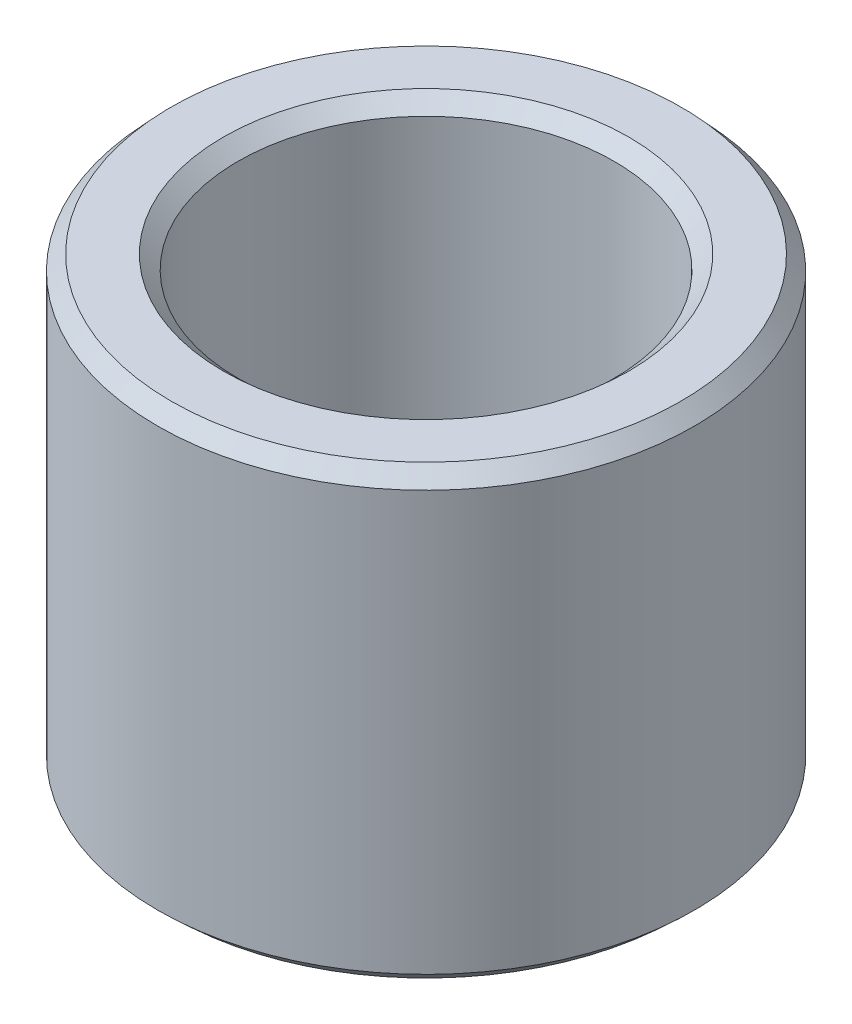
ISO-10303-21;
HEADER;
FILE_DESCRIPTION(('STEP AP214'),'2;1');
FILE_NAME('part.step','',(''),(''),'','','');
FILE_SCHEMA(('AUTOMOTIVE_DESIGN { 1 0 10303 214 1 1 1 1 }'));
ENDSEC;
DATA;
#1=APPLICATION_CONTEXT('core data for automotive mechanical design processes');
#2=APPLICATION_PROTOCOL_DEFINITION('international standard','automotive_design',2000,#1);
#3=PRODUCT_CONTEXT('',#1,'mechanical');
#4=PRODUCT('Part','Part','',(#3));
#5=PRODUCT_RELATED_PRODUCT_CATEGORY('part','',(#4));
#6=PRODUCT_DEFINITION_FORMATION('','',#4);
#7=PRODUCT_DEFINITION_CONTEXT('part definition',#1,'design');
#8=PRODUCT_DEFINITION('design','',#6,#7);
#9=PRODUCT_DEFINITION_SHAPE('','',#8);
#10=(LENGTH_UNIT() NAMED_UNIT(*) SI_UNIT(.MILLI.,.METRE.));
#11=(NAMED_UNIT(*) PLANE_ANGLE_UNIT() SI_UNIT($,.RADIAN.));
#12=(NAMED_UNIT(*) SI_UNIT($,.STERADIAN.) SOLID_ANGLE_UNIT());
#13=UNCERTAINTY_MEASURE_WITH_UNIT(LENGTH_MEASURE(1.E-05),#10,'distance_accuracy_value','');
#14=(GEOMETRIC_REPRESENTATION_CONTEXT(3) GLOBAL_UNCERTAINTY_ASSIGNED_CONTEXT((#13)) GLOBAL_UNIT_ASSIGNED_CONTEXT((#10,
#11,#12)) REPRESENTATION_CONTEXT('',''));
#15=CARTESIAN_POINT('',(0.,0.,0.));
#16=DIRECTION('',(0.,0.,1.));
#17=DIRECTION('',(1.,0.,0.));
#18=AXIS2_PLACEMENT_3D('',#15,#16,#17);
#19=CARTESIAN_POINT('',(0.,100.026628008681,0.));
#20=DIRECTION('',(0.,-1.,0.));
#21=DIRECTION('',(0.,0.,-1.));
#22=AXIS2_PLACEMENT_3D('',#19,#20,#21);
#23=CYLINDRICAL_SURFACE('',#22,60.);
#24=CARTESIAN_POINT('',(0.,3.04005425540567,0.));
#25=DIRECTION('',(0.,1.,0.));
#26=DIRECTION('',(0.,0.,1.));
#27=AXIS2_PLACEMENT_3D('',#24,#25,#26);
#28=CIRCLE('',#27,60.);
#29=CARTESIAN_POINT('',(0.,3.04005425540567,60.));
#30=VERTEX_POINT('',#29);
#31=EDGE_CURVE('E10',#30,#30,#28,.T.);
#32=ORIENTED_EDGE('',*,*,#31,.T.);
#33=EDGE_LOOP('',(#32));
#34=FACE_BOUND('',#33,.T.);
#35=CARTESIAN_POINT('',(0.,96.7378545931816,0.));
#36=DIRECTION('',(0.,1.,0.));
#37=DIRECTION('',(0.,0.,1.));
#38=AXIS2_PLACEMENT_3D('',#35,#36,#37);
#39=CIRCLE('',#38,60.);
#40=CARTESIAN_POINT('',(0.,96.7378545931816,60.));
#41=VERTEX_POINT('',#40);
#42=EDGE_CURVE('E50',#41,#41,#39,.F.);
#43=ORIENTED_EDGE('',*,*,#42,.T.);
#44=EDGE_LOOP('',(#43));
#45=FACE_BOUND('',#44,.T.);
#46=ADVANCED_FACE('F39',(#34,#45),#23,.T.);
#47=CARTESIAN_POINT('',(0.,100.026628008681,0.));
#48=DIRECTION('',(0.,1.,0.));
#49=DIRECTION('',(0.,0.,1.));
#50=AXIS2_PLACEMENT_3D('',#47,#48,#49);
#51=PLANE('',#50);
#52=CARTESIAN_POINT('',(0.,100.026628008681,0.));
#53=DIRECTION('',(0.,1.,0.));
#54=DIRECTION('',(0.,0.,1.));
#55=AXIS2_PLACEMENT_3D('',#52,#53,#54);
#56=CIRCLE('',#55,45.3146546919656);
#57=CARTESIAN_POINT('',(0.,100.026628008681,45.3146546919656));
#58=VERTEX_POINT('',#57);
#59=EDGE_CURVE('E58',#58,#58,#56,.F.);
#60=ORIENTED_EDGE('',*,*,#59,.T.);
#61=EDGE_LOOP('',(#60));
#62=FACE_BOUND('',#61,.T.);
#63=CARTESIAN_POINT('',(0.,100.026628008681,0.));
#64=DIRECTION('',(0.,1.,0.));
#65=DIRECTION('',(0.,0.,1.));
#66=AXIS2_PLACEMENT_3D('',#63,#64,#65);
#67=CIRCLE('',#66,56.9599457445943);
#68=CARTESIAN_POINT('',(0.,100.026628008681,56.9599457445943));
#69=VERTEX_POINT('',#68);
#70=EDGE_CURVE('E61',#69,#69,#67,.T.);
#71=ORIENTED_EDGE('',*,*,#70,.T.);
#72=EDGE_LOOP('',(#71));
#73=FACE_BOUND('',#72,.T.);
#74=ADVANCED_FACE('F88',(#62,#73),#51,.T.);
#75=CARTESIAN_POINT('',(0.,0.,0.));
#76=DIRECTION('',(0.,1.,0.));
#77=DIRECTION('',(0.,0.,1.));
#78=AXIS2_PLACEMENT_3D('',#75,#76,#77);
#79=PLANE('',#78);
#80=CARTESIAN_POINT('',(0.,0.,0.));
#81=DIRECTION('',(0.,1.,0.));
#82=DIRECTION('',(0.,0.,1.));
#83=AXIS2_PLACEMENT_3D('',#80,#81,#82);
#84=CIRCLE('',#83,45.0659355318715);
#85=CARTESIAN_POINT('',(0.,0.,45.0659355318715));
#86=VERTEX_POINT('',#85);
#87=EDGE_CURVE('E51',#86,#86,#84,.T.);
#88=ORIENTED_EDGE('',*,*,#87,.T.);
#89=EDGE_LOOP('',(#88));
#90=FACE_BOUND('',#89,.T.);
#91=CARTESIAN_POINT('',(0.,0.,0.));
#92=DIRECTION('',(0.,1.,0.));
#93=DIRECTION('',(0.,0.,1.));
#94=AXIS2_PLACEMENT_3D('',#91,#92,#93);
#95=CIRCLE('',#94,56.7112265845003);
#96=CARTESIAN_POINT('',(0.,0.,56.7112265845003));
#97=VERTEX_POINT('',#96);
#98=EDGE_CURVE('E54',#97,#97,#95,.F.);
#99=ORIENTED_EDGE('',*,*,#98,.T.);
#100=EDGE_LOOP('',(#99));
#101=FACE_BOUND('',#100,.T.);
#102=ADVANCED_FACE('F83',(#90,#101),#79,.F.);
#103=CARTESIAN_POINT('',(0.,100.026628008681,0.));
#104=DIRECTION('',(0.,-1.,0.));
#105=DIRECTION('',(0.,0.,-1.));
#106=AXIS2_PLACEMENT_3D('',#103,#104,#105);
#107=CYLINDRICAL_SURFACE('',#106,42.0258812764659);
#108=CARTESIAN_POINT('',(0.,96.9865737532758,0.));
#109=DIRECTION('',(0.,1.,0.));
#110=DIRECTION('',(0.,0.,1.));
#111=AXIS2_PLACEMENT_3D('',#108,#109,#110);
#112=CIRCLE('',#111,42.0258812764659);
#113=CARTESIAN_POINT('',(0.,96.9865737532758,42.0258812764658));
#114=VERTEX_POINT('',#113);
#115=EDGE_CURVE('E67',#114,#114,#112,.T.);
#116=ORIENTED_EDGE('',*,*,#115,.T.);
#117=EDGE_LOOP('',(#116));
#118=FACE_BOUND('',#117,.T.);
#119=CARTESIAN_POINT('',(0.,3.28877341549975,0.));
#120=DIRECTION('',(0.,1.,0.));
#121=DIRECTION('',(0.,0.,1.));
#122=AXIS2_PLACEMENT_3D('',#119,#120,#121);
#123=CIRCLE('',#122,42.0258812764659);
#124=CARTESIAN_POINT('',(0.,3.28877341549975,42.0258812764659));
#125=VERTEX_POINT('',#124);
#126=EDGE_CURVE('E69',#125,#125,#123,.F.);
#127=ORIENTED_EDGE('',*,*,#126,.T.);
#128=EDGE_LOOP('',(#127));
#129=FACE_BOUND('',#128,.T.);
#130=ADVANCED_FACE('F71',(#118,#129),#107,.F.);
#131=CARTESIAN_POINT('',(0.,96.9865737532758,0.));
#132=DIRECTION('',(0.,1.,0.));
#133=DIRECTION('',(0.,0.,1.));
#134=AXIS2_PLACEMENT_3D('',#131,#132,#133);
#135=CONICAL_SURFACE('',#134,42.0258812764659,0.824677354953602);
#136=CARTESIAN_POINT('',(0.,100.026628008681,45.3146546919656));
#137=CARTESIAN_POINT('',(0.,99.9949607768543,45.2803966355541));
#138=CARTESIAN_POINT('',(0.,99.9632935450272,45.2461385791427));
#139=CARTESIAN_POINT('',(0.,99.8999590813729,45.1776224663198));
#140=CARTESIAN_POINT('',(0.,99.8682918495458,45.1433644099083));
#141=CARTESIAN_POINT('',(0.,99.8049573858915,45.0748482970854));
#142=CARTESIAN_POINT('',(0.,99.7732901540643,45.040590240674));
#143=CARTESIAN_POINT('',(0.,99.7099556904101,44.972074127851));
#144=CARTESIAN_POINT('',(0.,99.6782884585829,44.9378160714396));
#145=CARTESIAN_POINT('',(0.,99.6149539949286,44.8692999586167));
#146=CARTESIAN_POINT('',(0.,99.5832867631015,44.8350419022052));
#147=CARTESIAN_POINT('',(0.,99.5199522994472,44.7665257893823));
#148=CARTESIAN_POINT('',(0.,99.48828506762,44.7322677329709));
#149=CARTESIAN_POINT('',(0.,99.4249506039658,44.6637516201479));
#150=CARTESIAN_POINT('',(0.,99.3932833721386,44.6294935637365));
#151=CARTESIAN_POINT('',(0.,99.3299489084843,44.5609774509136));
#152=CARTESIAN_POINT('',(0.,99.2982816766572,44.5267193945021));
#153=CARTESIAN_POINT('',(0.,99.2349472130029,44.4582032816792));
#154=CARTESIAN_POINT('',(0.,99.2032799811758,44.4239452252678));
#155=CARTESIAN_POINT('',(0.,99.1399455175215,44.3554291124448));
#156=CARTESIAN_POINT('',(0.,99.1082782856943,44.3211710560334));
#157=CARTESIAN_POINT('',(0.,99.0449438220401,44.2526549432105));
#158=CARTESIAN_POINT('',(0.,99.0132765902129,44.218396886799));
#159=CARTESIAN_POINT('',(0.,98.9499421265586,44.1498807739761));
#160=CARTESIAN_POINT('',(0.,98.9182748947315,44.1156227175646));
#161=CARTESIAN_POINT('',(0.,98.8549404310772,44.0471066047417));
#162=CARTESIAN_POINT('',(0.,98.8232731992501,44.0128485483303));
#163=CARTESIAN_POINT('',(0.,98.7599387355958,43.9443324355074));
#164=CARTESIAN_POINT('',(0.,98.7282715037686,43.9100743790959));
#165=CARTESIAN_POINT('',(0.,98.6649370401144,43.841558266273));
#166=CARTESIAN_POINT('',(0.,98.6332698082872,43.8073002098615));
#167=CARTESIAN_POINT('',(0.,98.5699353446329,43.7387840970386));
#168=CARTESIAN_POINT('',(0.,98.5382681128058,43.7045260406272));
#169=CARTESIAN_POINT('',(0.,98.4749336491515,43.6360099278043));
#170=CARTESIAN_POINT('',(0.,98.4432664173243,43.6017518713928));
#171=CARTESIAN_POINT('',(0.,98.3799319536701,43.5332357585699));
#172=CARTESIAN_POINT('',(0.,98.3482647218429,43.4989777021584));
#173=CARTESIAN_POINT('',(0.,98.2849302581886,43.4304615893355));
#174=CARTESIAN_POINT('',(0.,98.2532630263615,43.3962035329241));
#175=CARTESIAN_POINT('',(0.,98.1899285627072,43.3276874201012));
#176=CARTESIAN_POINT('',(0.,98.1582613308801,43.2934293636897));
#177=CARTESIAN_POINT('',(0.,98.0949268672258,43.2249132508668));
#178=CARTESIAN_POINT('',(0.,98.0632596353986,43.1906551944553));
#179=CARTESIAN_POINT('',(0.,97.9999251717444,43.1221390816324));
#180=CARTESIAN_POINT('',(0.,97.9682579399172,43.087881025221));
#181=CARTESIAN_POINT('',(0.,97.9049234762629,43.0193649123981));
#182=CARTESIAN_POINT('',(0.,97.8732562444358,42.9851068559866));
#183=CARTESIAN_POINT('',(0.,97.8099217807815,42.9165907431637));
#184=CARTESIAN_POINT('',(0.,97.7782545489544,42.8823326867522));
#185=CARTESIAN_POINT('',(0.,97.7149200853001,42.8138165739293));
#186=CARTESIAN_POINT('',(0.,97.6832528534729,42.7795585175179));
#187=CARTESIAN_POINT('',(0.,97.6199183898187,42.711042404695));
#188=CARTESIAN_POINT('',(0.,97.5882511579915,42.6767843482835));
#189=CARTESIAN_POINT('',(0.,97.5249166943372,42.6082682354606));
#190=CARTESIAN_POINT('',(0.,97.4932494625101,42.5740101790491));
#191=CARTESIAN_POINT('',(0.,97.4299149988558,42.5054940662262));
#192=CARTESIAN_POINT('',(0.,97.3982477670286,42.4712360098148));
#193=CARTESIAN_POINT('',(0.,97.3349133033744,42.4027198969919));
#194=CARTESIAN_POINT('',(0.,97.3032460715472,42.3684618405804));
#195=CARTESIAN_POINT('',(0.,97.2399116078929,42.2999457277575));
#196=CARTESIAN_POINT('',(0.,97.2082443760658,42.265687671346));
#197=CARTESIAN_POINT('',(0.,97.1449099124115,42.1971715585231));
#198=CARTESIAN_POINT('',(0.,97.1132426805844,42.1629135021117));
#199=CARTESIAN_POINT('',(0.,97.0499082169301,42.0943973892888));
#200=CARTESIAN_POINT('',(0.,97.0182409851029,42.0601393328773));
#201=CARTESIAN_POINT('',(0.,96.9865737532758,42.0258812764658));
#202=B_SPLINE_CURVE_WITH_KNOTS('',3,(#136,#137,#138,#139,#140,#141,#142,#143,#144,#145,#146,
#147,#148,#149,#150,#151,#152,#153,#154,#155,#156,#157,#158,#159,#160,#161,#162,#163,#164,#165,
#166,#167,#168,#169,#170,#171,#172,#173,#174,#175,#176,#177,#178,#179,#180,#181,#182,#183,#184,
#185,#186,#187,#188,#189,#190,#191,#192,#193,#194,#195,#196,#197,#198,#199,#200,#201),
.UNSPECIFIED.,.F.,.F.,(4,2,2,2,2,2,2,2,2,2,2,2,2,2,2,2,2,2,2,2,2,2,2,2,2,2,2,2,2,2,2,2,4),(0.,
0.139956607583062,0.279913215166129,0.419869822749191,0.559826430332262,0.699783037915319,
0.839739645498391,0.979696253081453,1.11965286066452,1.25960946824758,1.39956607583065,
1.53952268341372,1.67947929099678,1.81943589857984,1.95939250616292,2.09934911374597,
2.23930572132904,2.37926232891212,2.51921893649517,2.65917554407824,2.79913215166131,
2.93908875924438,3.07904536682743,3.21900197441051,3.35895858199357,3.49891518957663,
3.6388717971597,3.77882840474277,3.91878501232583,4.0587416199089,4.19869822749196,
4.33865483507503,4.47861144265809),.UNSPECIFIED.);
#203=EDGE_CURVE('BSEAM77',#58,#114,#202,.T.);
#204=ORIENTED_EDGE('',*,*,#59,.F.);
#205=ORIENTED_EDGE('',*,*,#115,.F.);
#206=ORIENTED_EDGE('',*,*,#203,.T.);
#207=ORIENTED_EDGE('',*,*,#203,.F.);
#208=EDGE_LOOP('',(#204,#206,#205,#207));
#209=FACE_BOUND('',#208,.T.);
#210=ADVANCED_FACE('F77',(#209),#135,.F.);
#211=CARTESIAN_POINT('',(0.,0.,0.));
#212=DIRECTION('',(0.,-1.,0.));
#213=DIRECTION('',(0.,0.,-1.));
#214=AXIS2_PLACEMENT_3D('',#211,#212,#213);
#215=CONICAL_SURFACE('',#214,45.0659355318715,0.746118971841299);
#216=ORIENTED_EDGE('',*,*,#126,.F.);
#217=EDGE_LOOP('',(#216));
#218=FACE_BOUND('',#217,.T.);
#219=ORIENTED_EDGE('',*,*,#87,.F.);
#220=EDGE_LOOP('',(#219));
#221=FACE_BOUND('',#220,.T.);
#222=ADVANCED_FACE('F73',(#218,#221),#215,.F.);
#223=CARTESIAN_POINT('',(0.,3.04005425540567,0.));
#224=DIRECTION('',(0.,1.,0.));
#225=DIRECTION('',(0.,0.,1.));
#226=AXIS2_PLACEMENT_3D('',#223,#224,#225);
#227=CONICAL_SURFACE('',#226,60.,0.8246773549536);
#228=CARTESIAN_POINT('',(0.,0.,56.7112265845003));
#229=CARTESIAN_POINT('',(0.,0.0316672318271428,56.7454846409117));
#230=CARTESIAN_POINT('',(0.,0.0633344636542851,56.7797426973232));
#231=CARTESIAN_POINT('',(0.,0.12666892730857,56.8482588101461));
#232=CARTESIAN_POINT('',(0.,0.158336159135712,56.8825168665575));
#233=CARTESIAN_POINT('',(0.,0.221670622789996,56.9510329793804));
#234=CARTESIAN_POINT('',(0.,0.253337854617138,56.9852910357919));
#235=CARTESIAN_POINT('',(0.,0.316672318271423,57.0538071486148));
#236=CARTESIAN_POINT('',(0.,0.348339550098566,57.0880652050263));
#237=CARTESIAN_POINT('',(0.,0.411674013752851,57.1565813178492));
#238=CARTESIAN_POINT('',(0.,0.443341245579993,57.1908393742606));
#239=CARTESIAN_POINT('',(0.,0.506675709234277,57.2593554870835));
#240=CARTESIAN_POINT('',(0.,0.538342941061419,57.293613543495));
#241=CARTESIAN_POINT('',(0.,0.601677404715705,57.3621296563179));
#242=CARTESIAN_POINT('',(0.,0.633344636542848,57.3963877127294));
#243=CARTESIAN_POINT('',(0.,0.696679100197133,57.4649038255523));
#244=CARTESIAN_POINT('',(0.,0.728346332024275,57.4991618819637));
#245=CARTESIAN_POINT('',(0.,0.791680795678559,57.5676779947866));
#246=CARTESIAN_POINT('',(0.,0.823348027505701,57.6019360511981));
#247=CARTESIAN_POINT('',(0.,0.886682491159986,57.670452164021));
#248=CARTESIAN_POINT('',(0.,0.91834972298713,57.7047102204325));
#249=CARTESIAN_POINT('',(0.,0.981684186641414,57.7732263332554));
#250=CARTESIAN_POINT('',(0.,1.01335141846856,57.8074843896668));
#251=CARTESIAN_POINT('',(0.,1.07668588212284,57.8760005024897));
#252=CARTESIAN_POINT('',(0.,1.10835311394998,57.9102585589012));
#253=CARTESIAN_POINT('',(0.,1.17168757760427,57.9787746717241));
#254=CARTESIAN_POINT('',(0.,1.20335480943141,58.0130327281356));
#255=CARTESIAN_POINT('',(0.,1.26668927308569,58.0815488409585));
#256=CARTESIAN_POINT('',(0.,1.29835650491284,58.1158068973699));
#257=CARTESIAN_POINT('',(0.,1.36169096856712,58.1843230101928));
#258=CARTESIAN_POINT('',(0.,1.39335820039427,58.2185810666043));
#259=CARTESIAN_POINT('',(0.,1.45669266404855,58.2870971794272));
#260=CARTESIAN_POINT('',(0.,1.48835989587569,58.3213552358387));
#261=CARTESIAN_POINT('',(0.,1.55169435952998,58.3898713486616));
#262=CARTESIAN_POINT('',(0.,1.58336159135712,58.424129405073));
#263=CARTESIAN_POINT('',(0.,1.6466960550114,58.492645517896));
#264=CARTESIAN_POINT('',(0.,1.67836328683855,58.5269035743074));
#265=CARTESIAN_POINT('',(0.,1.74169775049283,58.5954196871303));
#266=CARTESIAN_POINT('',(0.,1.77336498231997,58.6296777435418));
#267=CARTESIAN_POINT('',(0.,1.83669944597426,58.6981938563647));
#268=CARTESIAN_POINT('',(0.,1.8683666778014,58.7324519127761));
#269=CARTESIAN_POINT('',(0.,1.93170114145569,58.800968025599));
#270=CARTESIAN_POINT('',(0.,1.96336837328283,58.8352260820105));
#271=CARTESIAN_POINT('',(0.,2.02670283693711,58.9037421948334));
#272=CARTESIAN_POINT('',(0.,2.05837006876425,58.9380002512449));
#273=CARTESIAN_POINT('',(0.,2.12170453241854,59.0065163640678));
#274=CARTESIAN_POINT('',(0.,2.15337176424568,59.0407744204792));
#275=CARTESIAN_POINT('',(0.,2.21670622789997,59.1092905333022));
#276=CARTESIAN_POINT('',(0.,2.24837345972711,59.1435485897136));
#277=CARTESIAN_POINT('',(0.,2.31170792338139,59.2120647025365));
#278=CARTESIAN_POINT('',(0.,2.34337515520854,59.246322758948));
#279=CARTESIAN_POINT('',(0.,2.40670961886282,59.3148388717709));
#280=CARTESIAN_POINT('',(0.,2.43837685068996,59.3490969281823));
#281=CARTESIAN_POINT('',(0.,2.50171131434425,59.4176130410052));
#282=CARTESIAN_POINT('',(0.,2.53337854617139,59.4518710974167));
#283=CARTESIAN_POINT('',(0.,2.59671300982568,59.5203872102396));
#284=CARTESIAN_POINT('',(0.,2.62838024165282,59.5546452666511));
#285=CARTESIAN_POINT('',(0.,2.6917147053071,59.623161379474));
#286=CARTESIAN_POINT('',(0.,2.72338193713425,59.6574194358854));
#287=CARTESIAN_POINT('',(0.,2.78671640078853,59.7259355487083));
#288=CARTESIAN_POINT('',(0.,2.81838363261567,59.7601936051198));
#289=CARTESIAN_POINT('',(0.,2.88171809626996,59.8287097179427));
#290=CARTESIAN_POINT('',(0.,2.9133853280971,59.8629677743542));
#291=CARTESIAN_POINT('',(0.,2.97671979175139,59.9314838871771));
#292=CARTESIAN_POINT('',(0.,3.00838702357853,59.9657419435885));
#293=CARTESIAN_POINT('',(0.,3.04005425540567,60.));
#294=B_SPLINE_CURVE_WITH_KNOTS('',3,(#228,#229,#230,#231,#232,#233,#234,#235,#236,#237,#238,
#239,#240,#241,#242,#243,#244,#245,#246,#247,#248,#249,#250,#251,#252,#253,#254,#255,#256,#257,
#258,#259,#260,#261,#262,#263,#264,#265,#266,#267,#268,#269,#270,#271,#272,#273,#274,#275,#276,
#277,#278,#279,#280,#281,#282,#283,#284,#285,#286,#287,#288,#289,#290,#291,#292,#293),
.UNSPECIFIED.,.F.,.F.,(4,2,2,2,2,2,2,2,2,2,2,2,2,2,2,2,2,2,2,2,2,2,2,2,2,2,2,2,2,2,2,2,4),(0.,
0.139956607583062,0.279913215166129,0.419869822749196,0.559826430332258,0.699783037915325,
0.839739645498392,0.979696253081455,1.11965286066452,1.25960946824759,1.39956607583065,
1.53952268341372,1.67947929099678,1.81943589857985,1.95939250616291,2.09934911374598,
2.23930572132904,2.37926232891211,2.51921893649517,2.65917554407824,2.7991321516613,
2.93908875924437,3.07904536682744,3.2190019744105,3.35895858199357,3.49891518957663,
3.6388717971597,3.77882840474276,3.91878501232582,4.05874161990889,4.19869822749196,
4.33865483507502,4.47861144265809),.UNSPECIFIED.);
#295=EDGE_CURVE('BSEAM76',#97,#30,#294,.T.);
#296=ORIENTED_EDGE('',*,*,#98,.F.);
#297=ORIENTED_EDGE('',*,*,#31,.F.);
#298=ORIENTED_EDGE('',*,*,#295,.T.);
#299=ORIENTED_EDGE('',*,*,#295,.F.);
#300=EDGE_LOOP('',(#296,#298,#297,#299));
#301=FACE_BOUND('',#300,.T.);
#302=ADVANCED_FACE('F76',(#301),#227,.T.);
#303=CARTESIAN_POINT('',(0.,100.026628008681,0.));
#304=DIRECTION('',(0.,-1.,0.));
#305=DIRECTION('',(0.,0.,-1.));
#306=AXIS2_PLACEMENT_3D('',#303,#304,#305);
#307=CONICAL_SURFACE('',#306,56.9599457445943,0.746118971841292);
#308=ORIENTED_EDGE('',*,*,#42,.F.);
#309=EDGE_LOOP('',(#308));
#310=FACE_BOUND('',#309,.T.);
#311=ORIENTED_EDGE('',*,*,#70,.F.);
#312=EDGE_LOOP('',(#311));
#313=FACE_BOUND('',#312,.T.);
#314=ADVANCED_FACE('F45',(#310,#313),#307,.T.);
#315=CLOSED_SHELL('',(#46,#74,#102,#130,#210,#222,#302,#314));
#316=MANIFOLD_SOLID_BREP('B2',#315);
#317=ADVANCED_BREP_SHAPE_REPRESENTATION('',(#18,#316),#14);
#318=SHAPE_DEFINITION_REPRESENTATION(#9,#317);
ENDSEC;
END-ISO-10303-21;
